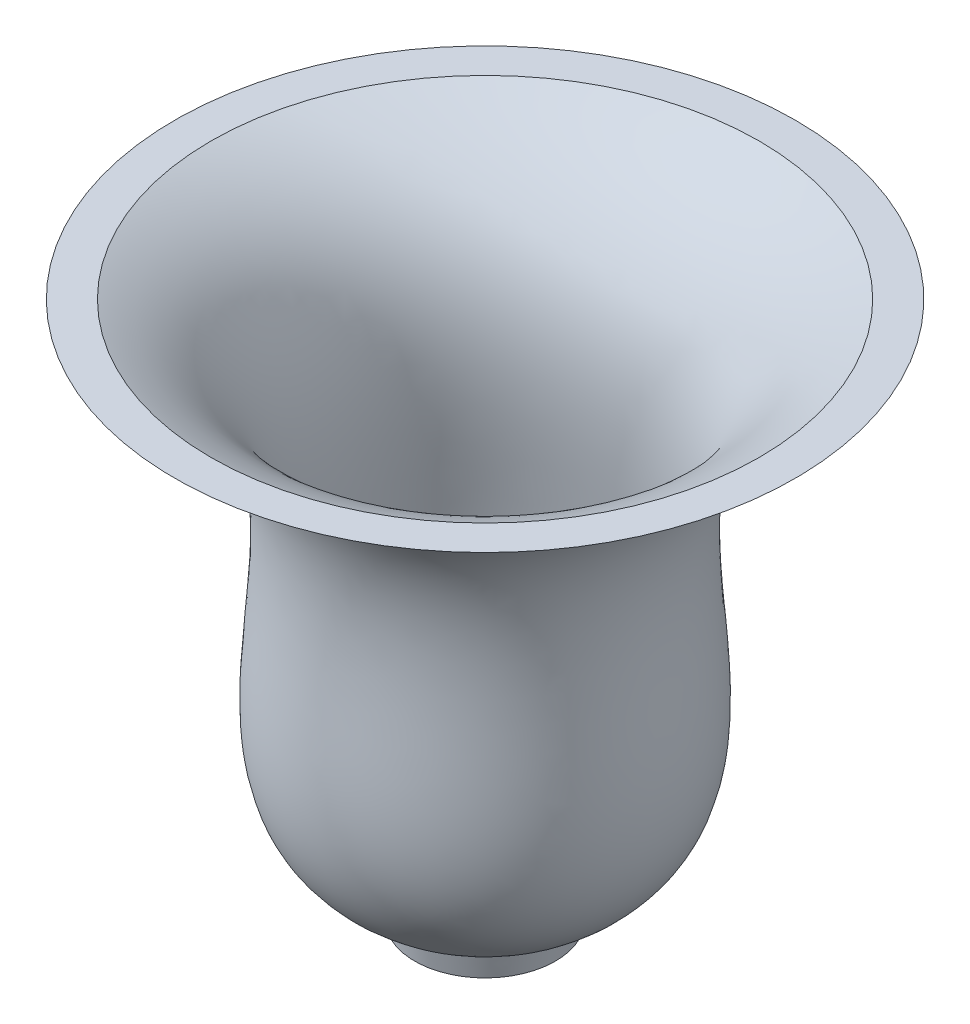
ISO-10303-21;
HEADER;
FILE_DESCRIPTION(('STEP AP214'),'2;1');
FILE_NAME('part.step','',(''),(''),'','','');
FILE_SCHEMA(('AUTOMOTIVE_DESIGN { 1 0 10303 214 1 1 1 1 }'));
ENDSEC;
DATA;
#1=APPLICATION_CONTEXT('core data for automotive mechanical design processes');
#2=APPLICATION_PROTOCOL_DEFINITION('international standard','automotive_design',2000,#1);
#3=PRODUCT_CONTEXT('',#1,'mechanical');
#4=PRODUCT('Part','Part','',(#3));
#5=PRODUCT_RELATED_PRODUCT_CATEGORY('part','',(#4));
#6=PRODUCT_DEFINITION_FORMATION('','',#4);
#7=PRODUCT_DEFINITION_CONTEXT('part definition',#1,'design');
#8=PRODUCT_DEFINITION('design','',#6,#7);
#9=PRODUCT_DEFINITION_SHAPE('','',#8);
#10=(LENGTH_UNIT() NAMED_UNIT(*) SI_UNIT(.MILLI.,.METRE.));
#11=(NAMED_UNIT(*) PLANE_ANGLE_UNIT() SI_UNIT($,.RADIAN.));
#12=(NAMED_UNIT(*) SI_UNIT($,.STERADIAN.) SOLID_ANGLE_UNIT());
#13=UNCERTAINTY_MEASURE_WITH_UNIT(LENGTH_MEASURE(1.E-05),#10,'distance_accuracy_value','');
#14=(GEOMETRIC_REPRESENTATION_CONTEXT(3) GLOBAL_UNCERTAINTY_ASSIGNED_CONTEXT((#13)) GLOBAL_UNIT_ASSIGNED_CONTEXT((#10,
#11,#12)) REPRESENTATION_CONTEXT('',''));
#15=CARTESIAN_POINT('',(0.,0.,0.));
#16=DIRECTION('',(0.,0.,1.));
#17=DIRECTION('',(1.,0.,0.));
#18=AXIS2_PLACEMENT_3D('',#15,#16,#17);
#19=CARTESIAN_POINT('',(8.17740807756109,37.4302021166117,0.));
#20=DIRECTION('',(0.,1.,0.));
#21=DIRECTION('',(0.,0.,1.));
#22=AXIS2_PLACEMENT_3D('',#19,#20,#21);
#23=PLANE('',#22);
#24=CARTESIAN_POINT('',(8.17740807756109,37.4302021166117,0.));
#25=DIRECTION('',(0.,-1.,0.));
#26=DIRECTION('',(0.,0.,-1.));
#27=AXIS2_PLACEMENT_3D('',#24,#25,#26);
#28=CIRCLE('',#27,30.8979642013968);
#29=CARTESIAN_POINT('',(8.17740807756109,37.4302021166117,-30.8979642013968));
#30=VERTEX_POINT('',#29);
#31=EDGE_CURVE('E43',#30,#30,#28,.T.);
#32=ORIENTED_EDGE('',*,*,#31,.T.);
#33=EDGE_LOOP('',(#32));
#34=FACE_BOUND('',#33,.T.);
#35=CARTESIAN_POINT('',(8.17740807756109,37.4302021166117,0.));
#36=DIRECTION('',(0.,-1.,0.));
#37=DIRECTION('',(0.,0.,-1.));
#38=AXIS2_PLACEMENT_3D('',#35,#36,#37);
#39=CIRCLE('',#38,34.9707072260697);
#40=CARTESIAN_POINT('',(8.17740807756109,37.4302021166117,-34.9707072260697));
#41=VERTEX_POINT('',#40);
#42=EDGE_CURVE('E10',#41,#41,#39,.T.);
#43=ORIENTED_EDGE('',*,*,#42,.F.);
#44=EDGE_LOOP('',(#43));
#45=FACE_BOUND('',#44,.T.);
#46=ADVANCED_FACE('F33',(#34,#45),#23,.T.);
#47=CARTESIAN_POINT('',(16.6461486026253,-20.2153668887126,0.));
#48=CARTESIAN_POINT('',(42.9278895251195,-8.54642728827353,0.));
#49=CARTESIAN_POINT('',(9.51929868667946,25.9067823042512,0.));
#50=CARTESIAN_POINT('',(43.1481153036308,37.4302021166117,0.));
#51=B_SPLINE_CURVE_WITH_KNOTS('',3,(#47,#48,#49,#50),.UNSPECIFIED.,.F.,.F.,(4,4),(0.,1.),.UNSPECIFIED.);
#52=CARTESIAN_POINT('',(8.17740807756109,-20.2153668887126,0.));
#53=DIRECTION('',(0.,-1.,0.));
#54=AXIS1_PLACEMENT('',#52,#53);
#55=SURFACE_OF_REVOLUTION('',#51,#54);
#56=ORIENTED_EDGE('',*,*,#42,.T.);
#57=EDGE_LOOP('',(#56));
#58=FACE_BOUND('',#57,.T.);
#59=CARTESIAN_POINT('',(8.17740807756109,-20.2153668887126,0.));
#60=DIRECTION('',(0.,-1.,0.));
#61=DIRECTION('',(0.,0.,-1.));
#62=AXIS2_PLACEMENT_3D('',#59,#60,#61);
#63=CIRCLE('',#62,8.46874052506419);
#64=CARTESIAN_POINT('',(8.17740807756109,-20.2153668887126,-8.46874052506419));
#65=VERTEX_POINT('',#64);
#66=EDGE_CURVE('E39',#65,#65,#63,.T.);
#67=ORIENTED_EDGE('',*,*,#66,.F.);
#68=EDGE_LOOP('',(#67));
#69=FACE_BOUND('',#68,.T.);
#70=ADVANCED_FACE('F58',(#58,#69),#55,.F.);
#71=CARTESIAN_POINT('',(16.6461486026253,-20.2153668887126,0.));
#72=CARTESIAN_POINT('',(42.9278895251195,-8.54642728827353,0.));
#73=CARTESIAN_POINT('',(9.51929868667946,25.9067823042512,0.));
#74=CARTESIAN_POINT('',(43.1481153036308,37.4302021166117,0.));
#75=B_SPLINE_CURVE_WITH_KNOTS('',3,(#71,#72,#73,#74),.UNSPECIFIED.,.F.,.F.,(4,4),(0.,1.),.UNSPECIFIED.);
#76=CARTESIAN_POINT('',(8.17740807756109,-20.2153668887126,0.));
#77=DIRECTION('',(0.,-1.,0.));
#78=AXIS1_PLACEMENT('',#76,#77);
#79=SURFACE_OF_REVOLUTION('',#75,#78);
#80=OFFSET_SURFACE('',#79,1.5,.F.);
#81=ORIENTED_EDGE('',*,*,#31,.F.);
#82=EDGE_LOOP('',(#81));
#83=FACE_BOUND('',#82,.T.);
#84=CARTESIAN_POINT('',(8.17740807756109,-18.7153668887126,0.));
#85=DIRECTION('',(0.,-1.,0.));
#86=DIRECTION('',(0.,0.,-1.));
#87=AXIS2_PLACEMENT_3D('',#84,#85,#86);
#88=CIRCLE('',#87,8.14600829251861);
#89=CARTESIAN_POINT('',(8.17740807756109,-18.7153668887126,-8.14600829251861));
#90=VERTEX_POINT('',#89);
#91=EDGE_CURVE('E47',#90,#90,#88,.T.);
#92=ORIENTED_EDGE('',*,*,#91,.T.);
#93=EDGE_LOOP('',(#92));
#94=FACE_BOUND('',#93,.T.);
#95=ADVANCED_FACE('F62',(#83,#94),#80,.T.);
#96=CARTESIAN_POINT('',(16.6461486026253,-18.7153668887126,0.));
#97=DIRECTION('',(0.,-1.,0.));
#98=DIRECTION('',(0.,0.,-1.));
#99=AXIS2_PLACEMENT_3D('',#96,#97,#98);
#100=PLANE('',#99);
#101=ORIENTED_EDGE('',*,*,#91,.F.);
#102=EDGE_LOOP('',(#101));
#103=FACE_BOUND('',#102,.T.);
#104=ADVANCED_FACE('F64',(#103),#100,.F.);
#105=CARTESIAN_POINT('',(8.17740807756109,-20.2153668887126,0.));
#106=DIRECTION('',(0.,1.,0.));
#107=DIRECTION('',(0.,0.,-1.));
#108=AXIS2_PLACEMENT_3D('',#105,#106,#107);
#109=CONICAL_SURFACE('',#108,8.46874052506419,0.174532925199433);
#110=CARTESIAN_POINT('',(8.17740807756109,-23.2153668887126,0.));
#111=DIRECTION('',(0.,-1.,0.));
#112=DIRECTION('',(0.,0.,-1.));
#113=AXIS2_PLACEMENT_3D('',#110,#111,#112);
#114=CIRCLE('',#113,7.93975958293879);
#115=CARTESIAN_POINT('',(8.17740807756109,-23.2153668887126,-7.93975958293879));
#116=VERTEX_POINT('',#115);
#117=EDGE_CURVE('E84',#116,#116,#114,.T.);
#118=ORIENTED_EDGE('',*,*,#117,.F.);
#119=EDGE_LOOP('',(#118));
#120=FACE_BOUND('',#119,.T.);
#121=ORIENTED_EDGE('',*,*,#66,.T.);
#122=EDGE_LOOP('',(#121));
#123=FACE_BOUND('',#122,.T.);
#124=ADVANCED_FACE('F66',(#120,#123),#109,.T.);
#125=CARTESIAN_POINT('',(8.17740807756109,-23.2153668887126,0.));
#126=DIRECTION('',(0.,-1.,0.));
#127=DIRECTION('',(0.,0.,-1.));
#128=AXIS2_PLACEMENT_3D('',#125,#126,#127);
#129=PLANE('',#128);
#130=CARTESIAN_POINT('',(8.17740807756109,-23.2153668887126,0.));
#131=DIRECTION('',(0.,-1.,0.));
#132=DIRECTION('',(0.,0.,-1.));
#133=AXIS2_PLACEMENT_3D('',#130,#131,#132);
#134=CIRCLE('',#133,7.12477187369639);
#135=CARTESIAN_POINT('',(8.17740807756109,-23.2153668887126,-7.12477187369639));
#136=VERTEX_POINT('',#135);
#137=EDGE_CURVE('E91',#136,#136,#134,.T.);
#138=ORIENTED_EDGE('',*,*,#137,.F.);
#139=EDGE_LOOP('',(#138));
#140=FACE_BOUND('',#139,.T.);
#141=ORIENTED_EDGE('',*,*,#117,.T.);
#142=EDGE_LOOP('',(#141));
#143=FACE_BOUND('',#142,.T.);
#144=ADVANCED_FACE('F72',(#140,#143),#129,.T.);
#145=CARTESIAN_POINT('',(8.17740807756109,-23.2153668887126,0.));
#146=DIRECTION('',(0.,-1.,0.));
#147=DIRECTION('',(0.,0.,-1.));
#148=AXIS2_PLACEMENT_3D('',#145,#146,#147);
#149=CONICAL_SURFACE('',#148,7.12477187369639,0.174532925199433);
#150=CARTESIAN_POINT('',(8.17740807756109,-20.2153668887126,0.));
#151=DIRECTION('',(0.,-1.,0.));
#152=DIRECTION('',(0.,0.,-1.));
#153=AXIS2_PLACEMENT_3D('',#150,#151,#152);
#154=CIRCLE('',#153,6.59579093157099);
#155=CARTESIAN_POINT('',(8.17740807756109,-20.2153668887126,-6.59579093157099));
#156=VERTEX_POINT('',#155);
#157=EDGE_CURVE('E86',#156,#156,#154,.T.);
#158=ORIENTED_EDGE('',*,*,#157,.F.);
#159=EDGE_LOOP('',(#158));
#160=FACE_BOUND('',#159,.T.);
#161=ORIENTED_EDGE('',*,*,#137,.T.);
#162=EDGE_LOOP('',(#161));
#163=FACE_BOUND('',#162,.T.);
#164=ADVANCED_FACE('F95',(#160,#163),#149,.F.);
#165=CARTESIAN_POINT('',(8.17740807756109,-20.2153668887126,0.));
#166=DIRECTION('',(0.,-1.,0.));
#167=DIRECTION('',(0.,0.,-1.));
#168=AXIS2_PLACEMENT_3D('',#165,#166,#167);
#169=PLANE('',#168);
#170=ORIENTED_EDGE('',*,*,#157,.T.);
#171=EDGE_LOOP('',(#170));
#172=FACE_BOUND('',#171,.T.);
#173=ADVANCED_FACE('F104',(#172),#169,.T.);
#174=CLOSED_SHELL('',(#46,#70,#95,#104,#124,#144,#164,#173));
#175=MANIFOLD_SOLID_BREP('B2',#174);
#176=ADVANCED_BREP_SHAPE_REPRESENTATION('',(#18,#175),#14);
#177=SHAPE_DEFINITION_REPRESENTATION(#9,#176);
ENDSEC;
END-ISO-10303-21;
